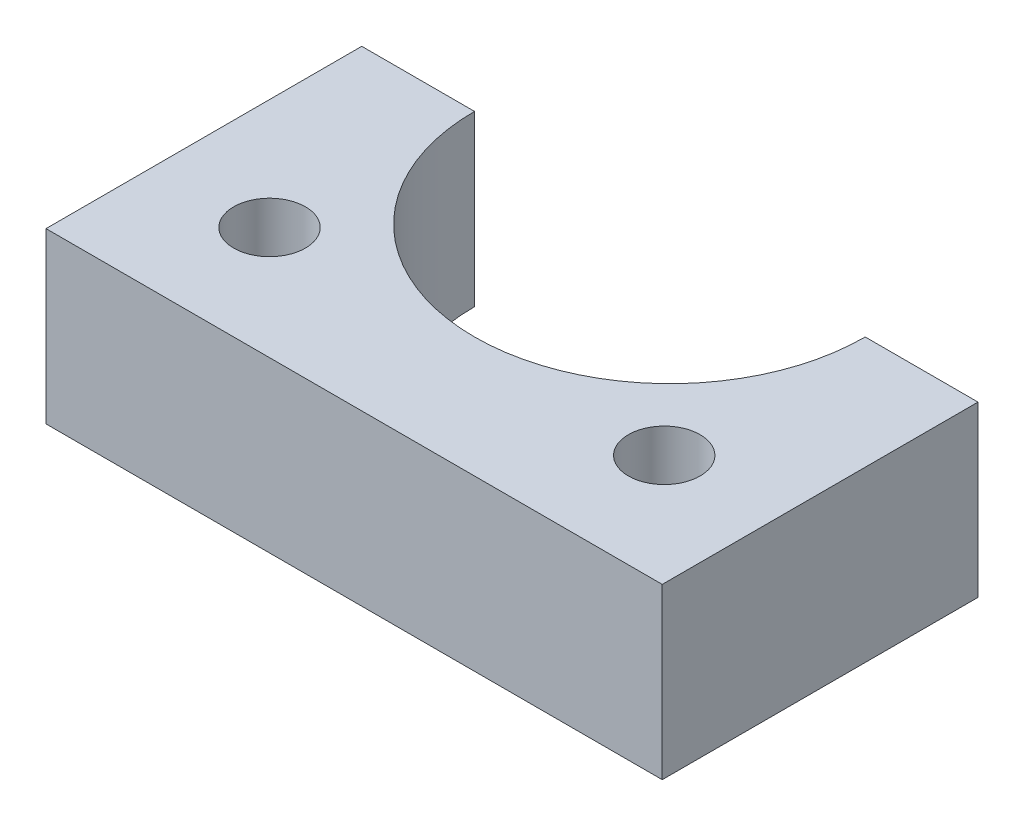
ISO-10303-21;
HEADER;
FILE_DESCRIPTION(('STEP AP214'),'2;1');
FILE_NAME('part.step','',(''),(''),'','','');
FILE_SCHEMA(('AUTOMOTIVE_DESIGN { 1 0 10303 214 1 1 1 1 }'));
ENDSEC;
DATA;
#1=APPLICATION_CONTEXT('core data for automotive mechanical design processes');
#2=APPLICATION_PROTOCOL_DEFINITION('international standard','automotive_design',2000,#1);
#3=PRODUCT_CONTEXT('',#1,'mechanical');
#4=PRODUCT('Part','Part','',(#3));
#5=PRODUCT_RELATED_PRODUCT_CATEGORY('part','',(#4));
#6=PRODUCT_DEFINITION_FORMATION('','',#4);
#7=PRODUCT_DEFINITION_CONTEXT('part definition',#1,'design');
#8=PRODUCT_DEFINITION('design','',#6,#7);
#9=PRODUCT_DEFINITION_SHAPE('','',#8);
#10=(LENGTH_UNIT() NAMED_UNIT(*) SI_UNIT(.MILLI.,.METRE.));
#11=(NAMED_UNIT(*) PLANE_ANGLE_UNIT() SI_UNIT($,.RADIAN.));
#12=(NAMED_UNIT(*) SI_UNIT($,.STERADIAN.) SOLID_ANGLE_UNIT());
#13=UNCERTAINTY_MEASURE_WITH_UNIT(LENGTH_MEASURE(1.E-05),#10,'distance_accuracy_value','');
#14=(GEOMETRIC_REPRESENTATION_CONTEXT(3) GLOBAL_UNCERTAINTY_ASSIGNED_CONTEXT((#13)) GLOBAL_UNIT_ASSIGNED_CONTEXT((#10,
#11,#12)) REPRESENTATION_CONTEXT('',''));
#15=CARTESIAN_POINT('',(0.,0.,0.));
#16=DIRECTION('',(0.,0.,1.));
#17=DIRECTION('',(1.,0.,0.));
#18=AXIS2_PLACEMENT_3D('',#15,#16,#17);
#19=CARTESIAN_POINT('',(0.,9.525,0.));
#20=DIRECTION('',(0.,-1.,0.));
#21=DIRECTION('',(0.,0.,-1.));
#22=AXIS2_PLACEMENT_3D('',#19,#20,#21);
#23=CYLINDRICAL_SURFACE('',#22,10.999999971);
#24=CARTESIAN_POINT('',(0.,0.,0.));
#25=DIRECTION('',(0.,-1.,0.));
#26=DIRECTION('',(0.,0.,1.));
#27=AXIS2_PLACEMENT_3D('',#24,#25,#26);
#28=CIRCLE('',#27,10.999999971);
#29=CARTESIAN_POINT('',(10.999999971,0.,0.));
#30=VERTEX_POINT('',#29);
#31=CARTESIAN_POINT('',(-10.999999971,0.,0.));
#32=VERTEX_POINT('',#31);
#33=EDGE_CURVE('E127',#30,#32,#28,.T.);
#34=ORIENTED_EDGE('',*,*,#33,.T.);
#35=DIRECTION('',(0.,-1.,0.));
#36=VECTOR('',#35,1.);
#37=CARTESIAN_POINT('',(-10.999999971,9.525,0.));
#38=LINE('',#37,#36);
#39=CARTESIAN_POINT('',(-10.999999971,9.525,0.));
#40=VERTEX_POINT('',#39);
#41=EDGE_CURVE('E11',#40,#32,#38,.T.);
#42=ORIENTED_EDGE('',*,*,#41,.F.);
#43=CARTESIAN_POINT('',(0.,9.525,0.));
#44=DIRECTION('',(0.,-1.,0.));
#45=DIRECTION('',(0.,0.,1.));
#46=AXIS2_PLACEMENT_3D('',#43,#44,#45);
#47=CIRCLE('',#46,10.999999971);
#48=CARTESIAN_POINT('',(10.999999971,9.525,0.));
#49=VERTEX_POINT('',#48);
#50=EDGE_CURVE('E145',#49,#40,#47,.T.);
#51=ORIENTED_EDGE('',*,*,#50,.F.);
#52=DIRECTION('',(0.,-1.,0.));
#53=VECTOR('',#52,1.);
#54=CARTESIAN_POINT('',(10.999999971,9.525,0.));
#55=LINE('',#54,#53);
#56=EDGE_CURVE('E123',#49,#30,#55,.T.);
#57=ORIENTED_EDGE('',*,*,#56,.T.);
#58=EDGE_LOOP('',(#34,#42,#51,#57));
#59=FACE_BOUND('',#58,.T.);
#60=ADVANCED_FACE('F39',(#59),#23,.F.);
#61=CARTESIAN_POINT('',(-17.349999971,9.525,0.));
#62=DIRECTION('',(0.,0.,1.));
#63=DIRECTION('',(1.,0.,0.));
#64=AXIS2_PLACEMENT_3D('',#61,#62,#63);
#65=PLANE('',#64);
#66=DIRECTION('',(-1.,0.,0.));
#67=VECTOR('',#66,1.);
#68=CARTESIAN_POINT('',(-17.349999971,0.,0.));
#69=LINE('',#68,#67);
#70=CARTESIAN_POINT('',(-17.349999971,0.,0.));
#71=VERTEX_POINT('',#70);
#72=EDGE_CURVE('E131',#32,#71,#69,.T.);
#73=ORIENTED_EDGE('',*,*,#72,.T.);
#74=DIRECTION('',(0.,-1.,0.));
#75=VECTOR('',#74,1.);
#76=CARTESIAN_POINT('',(-17.349999971,9.525,0.));
#77=LINE('',#76,#75);
#78=CARTESIAN_POINT('',(-17.349999971,9.525,0.));
#79=VERTEX_POINT('',#78);
#80=EDGE_CURVE('E48',#79,#71,#77,.T.);
#81=ORIENTED_EDGE('',*,*,#80,.F.);
#82=DIRECTION('',(-1.,0.,0.));
#83=VECTOR('',#82,1.);
#84=CARTESIAN_POINT('',(-17.349999971,9.525,0.));
#85=LINE('',#84,#83);
#86=EDGE_CURVE('E93',#40,#79,#85,.T.);
#87=ORIENTED_EDGE('',*,*,#86,.F.);
#88=ORIENTED_EDGE('',*,*,#41,.T.);
#89=EDGE_LOOP('',(#73,#81,#87,#88));
#90=FACE_BOUND('',#89,.T.);
#91=ADVANCED_FACE('F174',(#90),#65,.F.);
#92=CARTESIAN_POINT('',(-17.349999971,9.525,17.78));
#93=DIRECTION('',(1.,0.,0.));
#94=DIRECTION('',(0.,0.,-1.));
#95=AXIS2_PLACEMENT_3D('',#92,#93,#94);
#96=PLANE('',#95);
#97=DIRECTION('',(0.,0.,1.));
#98=VECTOR('',#97,1.);
#99=CARTESIAN_POINT('',(-17.349999971,0.,17.78));
#100=LINE('',#99,#98);
#101=CARTESIAN_POINT('',(-17.349999971,0.,17.78));
#102=VERTEX_POINT('',#101);
#103=EDGE_CURVE('E135',#71,#102,#100,.T.);
#104=ORIENTED_EDGE('',*,*,#103,.T.);
#105=DIRECTION('',(0.,-1.,0.));
#106=VECTOR('',#105,1.);
#107=CARTESIAN_POINT('',(-17.349999971,9.525,17.78));
#108=LINE('',#107,#106);
#109=CARTESIAN_POINT('',(-17.349999971,9.525,17.78));
#110=VERTEX_POINT('',#109);
#111=EDGE_CURVE('E116',#110,#102,#108,.T.);
#112=ORIENTED_EDGE('',*,*,#111,.F.);
#113=DIRECTION('',(0.,0.,1.));
#114=VECTOR('',#113,1.);
#115=CARTESIAN_POINT('',(-17.349999971,9.525,17.78));
#116=LINE('',#115,#114);
#117=EDGE_CURVE('E106',#79,#110,#116,.T.);
#118=ORIENTED_EDGE('',*,*,#117,.F.);
#119=ORIENTED_EDGE('',*,*,#80,.T.);
#120=EDGE_LOOP('',(#104,#112,#118,#119));
#121=FACE_BOUND('',#120,.T.);
#122=ADVANCED_FACE('F155',(#121),#96,.F.);
#123=CARTESIAN_POINT('',(17.349999971,9.525,17.78));
#124=DIRECTION('',(0.,0.,-1.));
#125=DIRECTION('',(-1.,0.,0.));
#126=AXIS2_PLACEMENT_3D('',#123,#124,#125);
#127=PLANE('',#126);
#128=DIRECTION('',(1.,0.,0.));
#129=VECTOR('',#128,1.);
#130=CARTESIAN_POINT('',(17.349999971,0.,17.78));
#131=LINE('',#130,#129);
#132=CARTESIAN_POINT('',(17.349999971,0.,17.78));
#133=VERTEX_POINT('',#132);
#134=EDGE_CURVE('E114',#102,#133,#131,.T.);
#135=ORIENTED_EDGE('',*,*,#134,.T.);
#136=DIRECTION('',(0.,-1.,0.));
#137=VECTOR('',#136,1.);
#138=CARTESIAN_POINT('',(17.349999971,9.525,17.78));
#139=LINE('',#138,#137);
#140=CARTESIAN_POINT('',(17.349999971,9.525,17.78));
#141=VERTEX_POINT('',#140);
#142=EDGE_CURVE('E112',#141,#133,#139,.T.);
#143=ORIENTED_EDGE('',*,*,#142,.F.);
#144=DIRECTION('',(1.,0.,0.));
#145=VECTOR('',#144,1.);
#146=CARTESIAN_POINT('',(-10.999999971,9.525,17.78));
#147=LINE('',#146,#145);
#148=EDGE_CURVE('E100',#110,#141,#147,.T.);
#149=ORIENTED_EDGE('',*,*,#148,.F.);
#150=ORIENTED_EDGE('',*,*,#111,.T.);
#151=EDGE_LOOP('',(#135,#143,#149,#150));
#152=FACE_BOUND('',#151,.T.);
#153=ADVANCED_FACE('F113',(#152),#127,.F.);
#154=CARTESIAN_POINT('',(17.349999971,9.525,0.));
#155=DIRECTION('',(-1.,0.,0.));
#156=DIRECTION('',(0.,0.,1.));
#157=AXIS2_PLACEMENT_3D('',#154,#155,#156);
#158=PLANE('',#157);
#159=DIRECTION('',(0.,0.,-1.));
#160=VECTOR('',#159,1.);
#161=CARTESIAN_POINT('',(17.349999971,0.,0.));
#162=LINE('',#161,#160);
#163=CARTESIAN_POINT('',(17.349999971,0.,0.));
#164=VERTEX_POINT('',#163);
#165=EDGE_CURVE('E79',#133,#164,#162,.T.);
#166=ORIENTED_EDGE('',*,*,#165,.T.);
#167=DIRECTION('',(0.,-1.,0.));
#168=VECTOR('',#167,1.);
#169=CARTESIAN_POINT('',(17.349999971,9.525,0.));
#170=LINE('',#169,#168);
#171=CARTESIAN_POINT('',(17.349999971,9.525,0.));
#172=VERTEX_POINT('',#171);
#173=EDGE_CURVE('E117',#172,#164,#170,.T.);
#174=ORIENTED_EDGE('',*,*,#173,.F.);
#175=DIRECTION('',(0.,0.,-1.));
#176=VECTOR('',#175,1.);
#177=CARTESIAN_POINT('',(17.349999971,9.525,0.));
#178=LINE('',#177,#176);
#179=EDGE_CURVE('E104',#141,#172,#178,.T.);
#180=ORIENTED_EDGE('',*,*,#179,.F.);
#181=ORIENTED_EDGE('',*,*,#142,.T.);
#182=EDGE_LOOP('',(#166,#174,#180,#181));
#183=FACE_BOUND('',#182,.T.);
#184=ADVANCED_FACE('F119',(#183),#158,.F.);
#185=CARTESIAN_POINT('',(10.999999971,9.525,0.));
#186=DIRECTION('',(0.,0.,1.));
#187=DIRECTION('',(1.,0.,0.));
#188=AXIS2_PLACEMENT_3D('',#185,#186,#187);
#189=PLANE('',#188);
#190=DIRECTION('',(-1.,0.,0.));
#191=VECTOR('',#190,1.);
#192=CARTESIAN_POINT('',(10.999999971,0.,0.));
#193=LINE('',#192,#191);
#194=EDGE_CURVE('E85',#164,#30,#193,.T.);
#195=ORIENTED_EDGE('',*,*,#194,.T.);
#196=ORIENTED_EDGE('',*,*,#56,.F.);
#197=DIRECTION('',(-1.,0.,0.));
#198=VECTOR('',#197,1.);
#199=CARTESIAN_POINT('',(10.999999971,9.525,0.));
#200=LINE('',#199,#198);
#201=EDGE_CURVE('E56',#172,#49,#200,.T.);
#202=ORIENTED_EDGE('',*,*,#201,.F.);
#203=ORIENTED_EDGE('',*,*,#173,.T.);
#204=EDGE_LOOP('',(#195,#196,#202,#203));
#205=FACE_BOUND('',#204,.T.);
#206=ADVANCED_FACE('F162',(#205),#189,.F.);
#207=CARTESIAN_POINT('',(0.,9.525,0.));
#208=DIRECTION('',(0.,1.,0.));
#209=DIRECTION('',(0.,0.,1.));
#210=AXIS2_PLACEMENT_3D('',#207,#208,#209);
#211=PLANE('',#210);
#212=CARTESIAN_POINT('',(11.1125,9.525,11.43));
#213=DIRECTION('',(0.,1.,0.));
#214=DIRECTION('',(0.,0.,1.));
#215=AXIS2_PLACEMENT_3D('',#212,#213,#214);
#216=CIRCLE('',#215,2.0193);
#217=CARTESIAN_POINT('',(11.1125,9.525,13.4493));
#218=VERTEX_POINT('',#217);
#219=EDGE_CURVE('E239',#218,#218,#216,.T.);
#220=ORIENTED_EDGE('',*,*,#219,.F.);
#221=EDGE_LOOP('',(#220));
#222=FACE_BOUND('',#221,.T.);
#223=CARTESIAN_POINT('',(-11.1125,9.525,11.43));
#224=DIRECTION('',(0.,1.,0.));
#225=DIRECTION('',(0.,0.,1.));
#226=AXIS2_PLACEMENT_3D('',#223,#224,#225);
#227=CIRCLE('',#226,2.0193);
#228=CARTESIAN_POINT('',(-11.1125,9.525,13.4493));
#229=VERTEX_POINT('',#228);
#230=EDGE_CURVE('E247',#229,#229,#227,.T.);
#231=ORIENTED_EDGE('',*,*,#230,.F.);
#232=EDGE_LOOP('',(#231));
#233=FACE_BOUND('',#232,.T.);
#234=ORIENTED_EDGE('',*,*,#50,.T.);
#235=ORIENTED_EDGE('',*,*,#86,.T.);
#236=ORIENTED_EDGE('',*,*,#117,.T.);
#237=ORIENTED_EDGE('',*,*,#148,.T.);
#238=ORIENTED_EDGE('',*,*,#179,.T.);
#239=ORIENTED_EDGE('',*,*,#201,.T.);
#240=EDGE_LOOP('',(#234,#235,#236,#237,#238,#239));
#241=FACE_BOUND('',#240,.T.);
#242=ADVANCED_FACE('F102',(#222,#233,#241),#211,.T.);
#243=CARTESIAN_POINT('',(0.,0.,0.));
#244=DIRECTION('',(0.,1.,0.));
#245=DIRECTION('',(0.,0.,1.));
#246=AXIS2_PLACEMENT_3D('',#243,#244,#245);
#247=PLANE('',#246);
#248=CARTESIAN_POINT('',(11.1125,0.,11.43));
#249=DIRECTION('',(0.,1.,0.));
#250=DIRECTION('',(0.,0.,1.));
#251=AXIS2_PLACEMENT_3D('',#248,#249,#250);
#252=CIRCLE('',#251,2.0193);
#253=CARTESIAN_POINT('',(11.1125,0.,13.4493));
#254=VERTEX_POINT('',#253);
#255=EDGE_CURVE('E132',#254,#254,#252,.T.);
#256=ORIENTED_EDGE('',*,*,#255,.T.);
#257=EDGE_LOOP('',(#256));
#258=FACE_BOUND('',#257,.T.);
#259=CARTESIAN_POINT('',(-11.1125,0.,11.43));
#260=DIRECTION('',(0.,1.,0.));
#261=DIRECTION('',(0.,0.,1.));
#262=AXIS2_PLACEMENT_3D('',#259,#260,#261);
#263=CIRCLE('',#262,2.0193);
#264=CARTESIAN_POINT('',(-11.1125,0.,13.4493));
#265=VERTEX_POINT('',#264);
#266=EDGE_CURVE('E241',#265,#265,#263,.T.);
#267=ORIENTED_EDGE('',*,*,#266,.T.);
#268=EDGE_LOOP('',(#267));
#269=FACE_BOUND('',#268,.T.);
#270=ORIENTED_EDGE('',*,*,#33,.F.);
#271=ORIENTED_EDGE('',*,*,#194,.F.);
#272=ORIENTED_EDGE('',*,*,#165,.F.);
#273=ORIENTED_EDGE('',*,*,#134,.F.);
#274=ORIENTED_EDGE('',*,*,#103,.F.);
#275=ORIENTED_EDGE('',*,*,#72,.F.);
#276=EDGE_LOOP('',(#270,#271,#272,#273,#274,#275));
#277=FACE_BOUND('',#276,.T.);
#278=ADVANCED_FACE('F158',(#258,#269,#277),#247,.F.);
#279=CARTESIAN_POINT('',(-11.1125,0.,11.43));
#280=DIRECTION('',(0.,1.,0.));
#281=DIRECTION('',(0.,0.,1.));
#282=AXIS2_PLACEMENT_3D('',#279,#280,#281);
#283=CYLINDRICAL_SURFACE('',#282,2.0193);
#284=ORIENTED_EDGE('',*,*,#266,.F.);
#285=EDGE_LOOP('',(#284));
#286=FACE_BOUND('',#285,.T.);
#287=ORIENTED_EDGE('',*,*,#230,.T.);
#288=EDGE_LOOP('',(#287));
#289=FACE_BOUND('',#288,.T.);
#290=ADVANCED_FACE('F211',(#286,#289),#283,.F.);
#291=CARTESIAN_POINT('',(11.1125,0.,11.43));
#292=DIRECTION('',(0.,1.,0.));
#293=DIRECTION('',(0.,0.,1.));
#294=AXIS2_PLACEMENT_3D('',#291,#292,#293);
#295=CYLINDRICAL_SURFACE('',#294,2.0193);
#296=ORIENTED_EDGE('',*,*,#255,.F.);
#297=EDGE_LOOP('',(#296));
#298=FACE_BOUND('',#297,.T.);
#299=ORIENTED_EDGE('',*,*,#219,.T.);
#300=EDGE_LOOP('',(#299));
#301=FACE_BOUND('',#300,.T.);
#302=ADVANCED_FACE('F220',(#298,#301),#295,.F.);
#303=CLOSED_SHELL('',(#60,#91,#122,#153,#184,#206,#242,#278,#290,#302));
#304=MANIFOLD_SOLID_BREP('B2',#303);
#305=ADVANCED_BREP_SHAPE_REPRESENTATION('',(#18,#304),#14);
#306=SHAPE_DEFINITION_REPRESENTATION(#9,#305);
ENDSEC;
END-ISO-10303-21;
